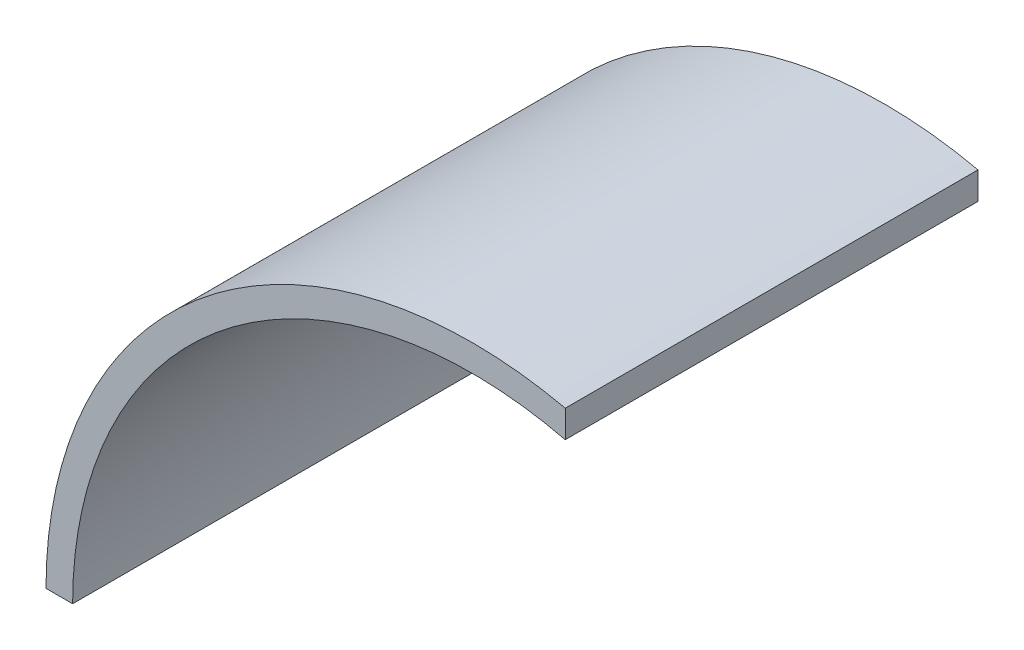
ISO-10303-21;
HEADER;
FILE_DESCRIPTION(('STEP AP214'),'2;1');
FILE_NAME('part.step','',(''),(''),'','','');
FILE_SCHEMA(('AUTOMOTIVE_DESIGN { 1 0 10303 214 1 1 1 1 }'));
ENDSEC;
DATA;
#1=APPLICATION_CONTEXT('core data for automotive mechanical design processes');
#2=APPLICATION_PROTOCOL_DEFINITION('international standard','automotive_design',2000,#1);
#3=PRODUCT_CONTEXT('',#1,'mechanical');
#4=PRODUCT('Part','Part','',(#3));
#5=PRODUCT_RELATED_PRODUCT_CATEGORY('part','',(#4));
#6=PRODUCT_DEFINITION_FORMATION('','',#4);
#7=PRODUCT_DEFINITION_CONTEXT('part definition',#1,'design');
#8=PRODUCT_DEFINITION('design','',#6,#7);
#9=PRODUCT_DEFINITION_SHAPE('','',#8);
#10=(LENGTH_UNIT() NAMED_UNIT(*) SI_UNIT(.MILLI.,.METRE.));
#11=(NAMED_UNIT(*) PLANE_ANGLE_UNIT() SI_UNIT($,.RADIAN.));
#12=(NAMED_UNIT(*) SI_UNIT($,.STERADIAN.) SOLID_ANGLE_UNIT());
#13=UNCERTAINTY_MEASURE_WITH_UNIT(LENGTH_MEASURE(1.E-05),#10,'distance_accuracy_value','');
#14=(GEOMETRIC_REPRESENTATION_CONTEXT(3) GLOBAL_UNCERTAINTY_ASSIGNED_CONTEXT((#13)) GLOBAL_UNIT_ASSIGNED_CONTEXT((#10,
#11,#12)) REPRESENTATION_CONTEXT('',''));
#15=CARTESIAN_POINT('',(0.,0.,0.));
#16=DIRECTION('',(0.,0.,1.));
#17=DIRECTION('',(1.,0.,0.));
#18=AXIS2_PLACEMENT_3D('',#15,#16,#17);
#19=CARTESIAN_POINT('',(0.,0.,155.));
#20=DIRECTION('',(0.,0.,-1.));
#21=DIRECTION('',(-1.,0.,0.));
#22=AXIS2_PLACEMENT_3D('',#19,#20,#21);
#23=CYLINDRICAL_SURFACE('',#22,160.);
#24=CARTESIAN_POINT('',(0.,0.,0.));
#25=DIRECTION('',(0.,0.,1.));
#26=DIRECTION('',(-1.,0.,0.));
#27=AXIS2_PLACEMENT_3D('',#24,#25,#26);
#28=CIRCLE('',#27,160.);
#29=CARTESIAN_POINT('',(35.,156.12494995996,0.));
#30=VERTEX_POINT('',#29);
#31=CARTESIAN_POINT('',(-160.,0.,0.));
#32=VERTEX_POINT('',#31);
#33=EDGE_CURVE('E100',#30,#32,#28,.T.);
#34=ORIENTED_EDGE('',*,*,#33,.T.);
#35=DIRECTION('',(0.,0.,-1.));
#36=VECTOR('',#35,1.);
#37=CARTESIAN_POINT('',(-160.,0.,155.));
#38=LINE('',#37,#36);
#39=CARTESIAN_POINT('',(-160.,0.,155.));
#40=VERTEX_POINT('',#39);
#41=EDGE_CURVE('E11',#40,#32,#38,.T.);
#42=ORIENTED_EDGE('',*,*,#41,.F.);
#43=CARTESIAN_POINT('',(0.,0.,155.));
#44=DIRECTION('',(0.,0.,1.));
#45=DIRECTION('',(-1.,0.,0.));
#46=AXIS2_PLACEMENT_3D('',#43,#44,#45);
#47=CIRCLE('',#46,160.);
#48=CARTESIAN_POINT('',(35.,156.12494995996,155.));
#49=VERTEX_POINT('',#48);
#50=EDGE_CURVE('E88',#49,#40,#47,.T.);
#51=ORIENTED_EDGE('',*,*,#50,.F.);
#52=DIRECTION('',(0.,0.,-1.));
#53=VECTOR('',#52,1.);
#54=CARTESIAN_POINT('',(35.,156.12494995996,155.));
#55=LINE('',#54,#53);
#56=EDGE_CURVE('E96',#49,#30,#55,.T.);
#57=ORIENTED_EDGE('',*,*,#56,.T.);
#58=EDGE_LOOP('',(#34,#42,#51,#57));
#59=FACE_BOUND('',#58,.T.);
#60=ADVANCED_FACE('F37',(#59),#23,.T.);
#61=CARTESIAN_POINT('',(-160.,0.,155.));
#62=DIRECTION('',(0.,1.,0.));
#63=DIRECTION('',(-1.,0.,0.));
#64=AXIS2_PLACEMENT_3D('',#61,#62,#63);
#65=PLANE('',#64);
#66=DIRECTION('',(1.,0.,0.));
#67=VECTOR('',#66,1.);
#68=CARTESIAN_POINT('',(-160.,0.,0.));
#69=LINE('',#68,#67);
#70=CARTESIAN_POINT('',(-150.,0.,0.));
#71=VERTEX_POINT('',#70);
#72=EDGE_CURVE('E92',#32,#71,#69,.T.);
#73=ORIENTED_EDGE('',*,*,#72,.T.);
#74=DIRECTION('',(0.,0.,-1.));
#75=VECTOR('',#74,1.);
#76=CARTESIAN_POINT('',(-150.,0.,155.));
#77=LINE('',#76,#75);
#78=CARTESIAN_POINT('',(-150.,0.,155.));
#79=VERTEX_POINT('',#78);
#80=EDGE_CURVE('E45',#79,#71,#77,.T.);
#81=ORIENTED_EDGE('',*,*,#80,.F.);
#82=DIRECTION('',(1.,0.,0.));
#83=VECTOR('',#82,1.);
#84=CARTESIAN_POINT('',(-160.,0.,155.));
#85=LINE('',#84,#83);
#86=EDGE_CURVE('E83',#40,#79,#85,.T.);
#87=ORIENTED_EDGE('',*,*,#86,.F.);
#88=ORIENTED_EDGE('',*,*,#41,.T.);
#89=EDGE_LOOP('',(#73,#81,#87,#88));
#90=FACE_BOUND('',#89,.T.);
#91=ADVANCED_FACE('F91',(#90),#65,.F.);
#92=CARTESIAN_POINT('',(0.,0.,155.));
#93=DIRECTION('',(0.,0.,-1.));
#94=DIRECTION('',(-1.,0.,0.));
#95=AXIS2_PLACEMENT_3D('',#92,#93,#94);
#96=CYLINDRICAL_SURFACE('',#95,150.);
#97=CARTESIAN_POINT('',(0.,0.,0.));
#98=DIRECTION('',(0.,0.,-1.));
#99=DIRECTION('',(-1.,0.,0.));
#100=AXIS2_PLACEMENT_3D('',#97,#98,#99);
#101=CIRCLE('',#100,150.);
#102=CARTESIAN_POINT('',(35.,145.859521458148,0.));
#103=VERTEX_POINT('',#102);
#104=EDGE_CURVE('E70',#71,#103,#101,.T.);
#105=ORIENTED_EDGE('',*,*,#104,.T.);
#106=DIRECTION('',(0.,0.,-1.));
#107=VECTOR('',#106,1.);
#108=CARTESIAN_POINT('',(35.,145.859521458148,155.));
#109=LINE('',#108,#107);
#110=CARTESIAN_POINT('',(35.,145.859521458148,155.));
#111=VERTEX_POINT('',#110);
#112=EDGE_CURVE('E93',#111,#103,#109,.T.);
#113=ORIENTED_EDGE('',*,*,#112,.F.);
#114=CARTESIAN_POINT('',(0.,0.,155.));
#115=DIRECTION('',(0.,0.,-1.));
#116=DIRECTION('',(-1.,0.,0.));
#117=AXIS2_PLACEMENT_3D('',#114,#115,#116);
#118=CIRCLE('',#117,150.);
#119=EDGE_CURVE('E86',#79,#111,#118,.T.);
#120=ORIENTED_EDGE('',*,*,#119,.F.);
#121=ORIENTED_EDGE('',*,*,#80,.T.);
#122=EDGE_LOOP('',(#105,#113,#120,#121));
#123=FACE_BOUND('',#122,.T.);
#124=ADVANCED_FACE('F94',(#123),#96,.F.);
#125=CARTESIAN_POINT('',(35.,156.12494995996,155.));
#126=DIRECTION('',(-1.,0.,0.));
#127=DIRECTION('',(0.,0.,1.));
#128=AXIS2_PLACEMENT_3D('',#125,#126,#127);
#129=PLANE('',#128);
#130=DIRECTION('',(0.,1.,0.));
#131=VECTOR('',#130,1.);
#132=CARTESIAN_POINT('',(35.,156.12494995996,0.));
#133=LINE('',#132,#131);
#134=EDGE_CURVE('E76',#103,#30,#133,.T.);
#135=ORIENTED_EDGE('',*,*,#134,.T.);
#136=ORIENTED_EDGE('',*,*,#56,.F.);
#137=DIRECTION('',(0.,1.,0.));
#138=VECTOR('',#137,1.);
#139=CARTESIAN_POINT('',(35.,156.12494995996,155.));
#140=LINE('',#139,#138);
#141=EDGE_CURVE('E53',#111,#49,#140,.T.);
#142=ORIENTED_EDGE('',*,*,#141,.F.);
#143=ORIENTED_EDGE('',*,*,#112,.T.);
#144=EDGE_LOOP('',(#135,#136,#142,#143));
#145=FACE_BOUND('',#144,.T.);
#146=ADVANCED_FACE('F107',(#145),#129,.F.);
#147=CARTESIAN_POINT('',(0.,0.,155.));
#148=DIRECTION('',(0.,0.,-1.));
#149=DIRECTION('',(-1.,0.,0.));
#150=AXIS2_PLACEMENT_3D('',#147,#148,#149);
#151=PLANE('',#150);
#152=ORIENTED_EDGE('',*,*,#50,.T.);
#153=ORIENTED_EDGE('',*,*,#86,.T.);
#154=ORIENTED_EDGE('',*,*,#119,.T.);
#155=ORIENTED_EDGE('',*,*,#141,.T.);
#156=EDGE_LOOP('',(#152,#153,#154,#155));
#157=FACE_BOUND('',#156,.T.);
#158=ADVANCED_FACE('F84',(#157),#151,.F.);
#159=CARTESIAN_POINT('',(0.,0.,0.));
#160=DIRECTION('',(0.,0.,-1.));
#161=DIRECTION('',(-1.,0.,0.));
#162=AXIS2_PLACEMENT_3D('',#159,#160,#161);
#163=PLANE('',#162);
#164=ORIENTED_EDGE('',*,*,#33,.F.);
#165=ORIENTED_EDGE('',*,*,#134,.F.);
#166=ORIENTED_EDGE('',*,*,#104,.F.);
#167=ORIENTED_EDGE('',*,*,#72,.F.);
#168=EDGE_LOOP('',(#164,#165,#166,#167));
#169=FACE_BOUND('',#168,.T.);
#170=ADVANCED_FACE('F110',(#169),#163,.T.);
#171=CLOSED_SHELL('',(#60,#91,#124,#146,#158,#170));
#172=MANIFOLD_SOLID_BREP('B2',#171);
#173=ADVANCED_BREP_SHAPE_REPRESENTATION('',(#18,#172),#14);
#174=SHAPE_DEFINITION_REPRESENTATION(#9,#173);
ENDSEC;
END-ISO-10303-21;
